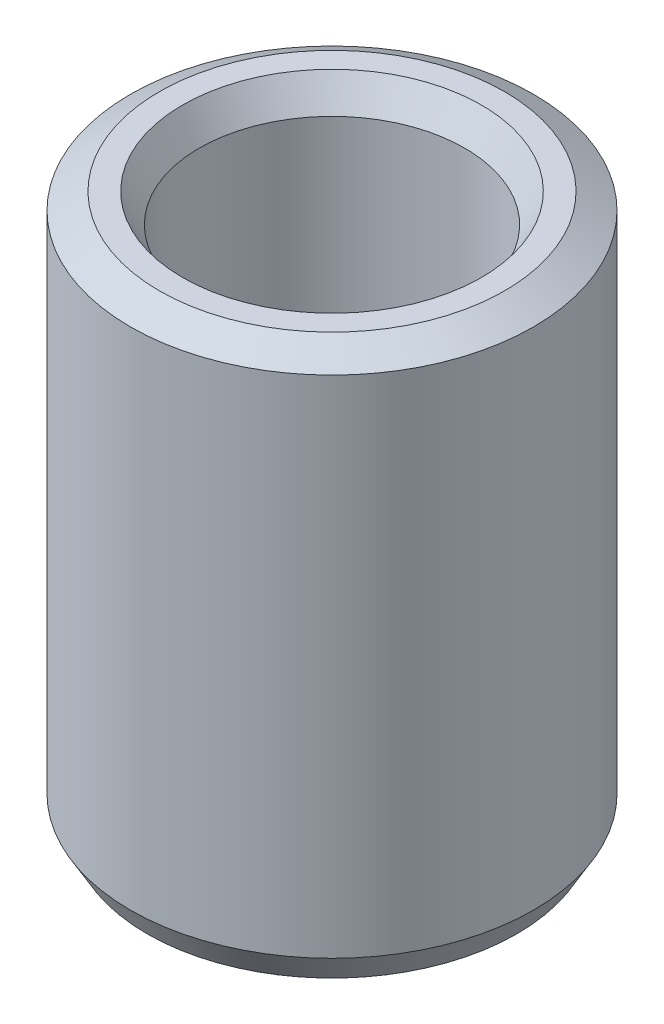
ISO-10303-21;
HEADER;
FILE_DESCRIPTION(('STEP AP214'),'2;1');
FILE_NAME('part.step','',(''),(''),'','','');
FILE_SCHEMA(('AUTOMOTIVE_DESIGN { 1 0 10303 214 1 1 1 1 }'));
ENDSEC;
DATA;
#1=APPLICATION_CONTEXT('core data for automotive mechanical design processes');
#2=APPLICATION_PROTOCOL_DEFINITION('international standard','automotive_design',2000,#1);
#3=PRODUCT_CONTEXT('',#1,'mechanical');
#4=PRODUCT('Part','Part','',(#3));
#5=PRODUCT_RELATED_PRODUCT_CATEGORY('part','',(#4));
#6=PRODUCT_DEFINITION_FORMATION('','',#4);
#7=PRODUCT_DEFINITION_CONTEXT('part definition',#1,'design');
#8=PRODUCT_DEFINITION('design','',#6,#7);
#9=PRODUCT_DEFINITION_SHAPE('','',#8);
#10=(LENGTH_UNIT() NAMED_UNIT(*) SI_UNIT(.MILLI.,.METRE.));
#11=(NAMED_UNIT(*) PLANE_ANGLE_UNIT() SI_UNIT($,.RADIAN.));
#12=(NAMED_UNIT(*) SI_UNIT($,.STERADIAN.) SOLID_ANGLE_UNIT());
#13=UNCERTAINTY_MEASURE_WITH_UNIT(LENGTH_MEASURE(1.E-05),#10,'distance_accuracy_value','');
#14=(GEOMETRIC_REPRESENTATION_CONTEXT(3) GLOBAL_UNCERTAINTY_ASSIGNED_CONTEXT((#13)) GLOBAL_UNIT_ASSIGNED_CONTEXT((#10,
#11,#12)) REPRESENTATION_CONTEXT('',''));
#15=CARTESIAN_POINT('',(0.,0.,0.));
#16=DIRECTION('',(0.,0.,1.));
#17=DIRECTION('',(1.,0.,0.));
#18=AXIS2_PLACEMENT_3D('',#15,#16,#17);
#19=CARTESIAN_POINT('',(0.,88.8155711018126,0.));
#20=DIRECTION('',(0.,-1.,0.));
#21=DIRECTION('',(0.,0.,-1.));
#22=AXIS2_PLACEMENT_3D('',#19,#20,#21);
#23=CYLINDRICAL_SURFACE('',#22,32.5);
#24=CARTESIAN_POINT('',(0.,4.66993668936701,0.));
#25=DIRECTION('',(0.,1.,0.));
#26=DIRECTION('',(0.,0.,1.));
#27=AXIS2_PLACEMENT_3D('',#24,#25,#26);
#28=CIRCLE('',#27,32.5);
#29=CARTESIAN_POINT('',(0.,4.66993668936701,32.5));
#30=VERTEX_POINT('',#29);
#31=EDGE_CURVE('E10',#30,#30,#28,.T.);
#32=ORIENTED_EDGE('',*,*,#31,.T.);
#33=EDGE_LOOP('',(#32));
#34=FACE_BOUND('',#33,.T.);
#35=CARTESIAN_POINT('',(0.,86.119381897108,0.));
#36=DIRECTION('',(0.,1.,0.));
#37=DIRECTION('',(0.,0.,1.));
#38=AXIS2_PLACEMENT_3D('',#35,#36,#37);
#39=CIRCLE('',#38,32.5);
#40=CARTESIAN_POINT('',(0.,86.119381897108,32.5));
#41=VERTEX_POINT('',#40);
#42=EDGE_CURVE('E50',#41,#41,#39,.F.);
#43=ORIENTED_EDGE('',*,*,#42,.T.);
#44=EDGE_LOOP('',(#43));
#45=FACE_BOUND('',#44,.T.);
#46=ADVANCED_FACE('F39',(#34,#45),#23,.T.);
#47=CARTESIAN_POINT('',(0.,88.8155711018126,0.));
#48=DIRECTION('',(0.,1.,0.));
#49=DIRECTION('',(0.,0.,1.));
#50=AXIS2_PLACEMENT_3D('',#47,#48,#49);
#51=PLANE('',#50);
#52=CARTESIAN_POINT('',(0.,88.8155711018126,0.));
#53=DIRECTION('',(0.,1.,0.));
#54=DIRECTION('',(0.,0.,1.));
#55=AXIS2_PLACEMENT_3D('',#52,#53,#54);
#56=CIRCLE('',#55,24.0964498300519);
#57=CARTESIAN_POINT('',(0.,88.8155711018126,24.0964498300519));
#58=VERTEX_POINT('',#57);
#59=EDGE_CURVE('E58',#58,#58,#56,.F.);
#60=ORIENTED_EDGE('',*,*,#59,.T.);
#61=EDGE_LOOP('',(#60));
#62=FACE_BOUND('',#61,.T.);
#63=CARTESIAN_POINT('',(0.,88.8155711018126,0.));
#64=DIRECTION('',(0.,1.,0.));
#65=DIRECTION('',(0.,0.,1.));
#66=AXIS2_PLACEMENT_3D('',#63,#64,#65);
#67=CIRCLE('',#66,27.830063310633);
#68=CARTESIAN_POINT('',(0.,88.8155711018126,27.830063310633));
#69=VERTEX_POINT('',#68);
#70=EDGE_CURVE('E61',#69,#69,#67,.T.);
#71=ORIENTED_EDGE('',*,*,#70,.T.);
#72=EDGE_LOOP('',(#71));
#73=FACE_BOUND('',#72,.T.);
#74=ADVANCED_FACE('F88',(#62,#73),#51,.T.);
#75=CARTESIAN_POINT('',(0.,0.,0.));
#76=DIRECTION('',(0.,1.,0.));
#77=DIRECTION('',(0.,0.,1.));
#78=AXIS2_PLACEMENT_3D('',#75,#76,#77);
#79=PLANE('',#78);
#80=CARTESIAN_POINT('',(0.,0.,0.));
#81=DIRECTION('',(0.,1.,0.));
#82=DIRECTION('',(0.,0.,1.));
#83=AXIS2_PLACEMENT_3D('',#80,#81,#82);
#84=CIRCLE('',#83,26.0701973147142);
#85=CARTESIAN_POINT('',(0.,0.,26.0701973147142));
#86=VERTEX_POINT('',#85);
#87=EDGE_CURVE('E51',#86,#86,#84,.T.);
#88=ORIENTED_EDGE('',*,*,#87,.T.);
#89=EDGE_LOOP('',(#88));
#90=FACE_BOUND('',#89,.T.);
#91=CARTESIAN_POINT('',(0.,0.,0.));
#92=DIRECTION('',(0.,1.,0.));
#93=DIRECTION('',(0.,0.,1.));
#94=AXIS2_PLACEMENT_3D('',#91,#92,#93);
#95=CIRCLE('',#94,29.8038107952954);
#96=CARTESIAN_POINT('',(0.,0.,29.8038107952954));
#97=VERTEX_POINT('',#96);
#98=EDGE_CURVE('E54',#97,#97,#95,.F.);
#99=ORIENTED_EDGE('',*,*,#98,.T.);
#100=EDGE_LOOP('',(#99));
#101=FACE_BOUND('',#100,.T.);
#102=ADVANCED_FACE('F83',(#90,#101),#79,.F.);
#103=CARTESIAN_POINT('',(0.,88.8155711018126,0.));
#104=DIRECTION('',(0.,-1.,0.));
#105=DIRECTION('',(0.,0.,-1.));
#106=AXIS2_PLACEMENT_3D('',#103,#104,#105);
#107=CYLINDRICAL_SURFACE('',#106,21.4002606253473);
#108=CARTESIAN_POINT('',(0.,84.1456344124455,0.));
#109=DIRECTION('',(0.,1.,0.));
#110=DIRECTION('',(0.,0.,1.));
#111=AXIS2_PLACEMENT_3D('',#108,#109,#110);
#112=CIRCLE('',#111,21.4002606253473);
#113=CARTESIAN_POINT('',(0.,84.1456344124455,21.4002606253473));
#114=VERTEX_POINT('',#113);
#115=EDGE_CURVE('E67',#114,#114,#112,.T.);
#116=ORIENTED_EDGE('',*,*,#115,.T.);
#117=EDGE_LOOP('',(#116));
#118=FACE_BOUND('',#117,.T.);
#119=CARTESIAN_POINT('',(0.,2.69618920470455,0.));
#120=DIRECTION('',(0.,1.,0.));
#121=DIRECTION('',(0.,0.,1.));
#122=AXIS2_PLACEMENT_3D('',#119,#120,#121);
#123=CIRCLE('',#122,21.4002606253473);
#124=CARTESIAN_POINT('',(0.,2.69618920470455,21.4002606253473));
#125=VERTEX_POINT('',#124);
#126=EDGE_CURVE('E69',#125,#125,#123,.F.);
#127=ORIENTED_EDGE('',*,*,#126,.T.);
#128=EDGE_LOOP('',(#127));
#129=FACE_BOUND('',#128,.T.);
#130=ADVANCED_FACE('F71',(#118,#129),#107,.F.);
#131=CARTESIAN_POINT('',(0.,84.1456344124455,0.));
#132=DIRECTION('',(0.,1.,0.));
#133=DIRECTION('',(0.,0.,1.));
#134=AXIS2_PLACEMENT_3D('',#131,#132,#133);
#135=CONICAL_SURFACE('',#134,21.4002606253473,0.523598775598304);
#136=ORIENTED_EDGE('',*,*,#59,.F.);
#137=EDGE_LOOP('',(#136));
#138=FACE_BOUND('',#137,.T.);
#139=ORIENTED_EDGE('',*,*,#115,.F.);
#140=EDGE_LOOP('',(#139));
#141=FACE_BOUND('',#140,.T.);
#142=ADVANCED_FACE('F77',(#138,#141),#135,.F.);
#143=CARTESIAN_POINT('',(0.,0.,0.));
#144=DIRECTION('',(0.,-1.,0.));
#145=DIRECTION('',(0.,0.,-1.));
#146=AXIS2_PLACEMENT_3D('',#143,#144,#145);
#147=CONICAL_SURFACE('',#146,26.0701973147142,1.04719755119659);
#148=ORIENTED_EDGE('',*,*,#126,.F.);
#149=EDGE_LOOP('',(#148));
#150=FACE_BOUND('',#149,.T.);
#151=ORIENTED_EDGE('',*,*,#87,.F.);
#152=EDGE_LOOP('',(#151));
#153=FACE_BOUND('',#152,.T.);
#154=ADVANCED_FACE('F73',(#150,#153),#147,.F.);
#155=CARTESIAN_POINT('',(0.,4.66993668936701,0.));
#156=DIRECTION('',(0.,1.,0.));
#157=DIRECTION('',(0.,0.,1.));
#158=AXIS2_PLACEMENT_3D('',#155,#156,#157);
#159=CONICAL_SURFACE('',#158,32.5,0.523598775598302);
#160=ORIENTED_EDGE('',*,*,#98,.F.);
#161=EDGE_LOOP('',(#160));
#162=FACE_BOUND('',#161,.T.);
#163=ORIENTED_EDGE('',*,*,#31,.F.);
#164=EDGE_LOOP('',(#163));
#165=FACE_BOUND('',#164,.T.);
#166=ADVANCED_FACE('F76',(#162,#165),#159,.T.);
#167=CARTESIAN_POINT('',(0.,88.8155711018126,0.));
#168=DIRECTION('',(0.,-1.,0.));
#169=DIRECTION('',(0.,0.,-1.));
#170=AXIS2_PLACEMENT_3D('',#167,#168,#169);
#171=CONICAL_SURFACE('',#170,27.830063310633,1.04719755119659);
#172=ORIENTED_EDGE('',*,*,#42,.F.);
#173=EDGE_LOOP('',(#172));
#174=FACE_BOUND('',#173,.T.);
#175=ORIENTED_EDGE('',*,*,#70,.F.);
#176=EDGE_LOOP('',(#175));
#177=FACE_BOUND('',#176,.T.);
#178=ADVANCED_FACE('F45',(#174,#177),#171,.T.);
#179=CLOSED_SHELL('',(#46,#74,#102,#130,#142,#154,#166,#178));
#180=MANIFOLD_SOLID_BREP('B2',#179);
#181=ADVANCED_BREP_SHAPE_REPRESENTATION('',(#18,#180),#14);
#182=SHAPE_DEFINITION_REPRESENTATION(#9,#181);
ENDSEC;
END-ISO-10303-21;
